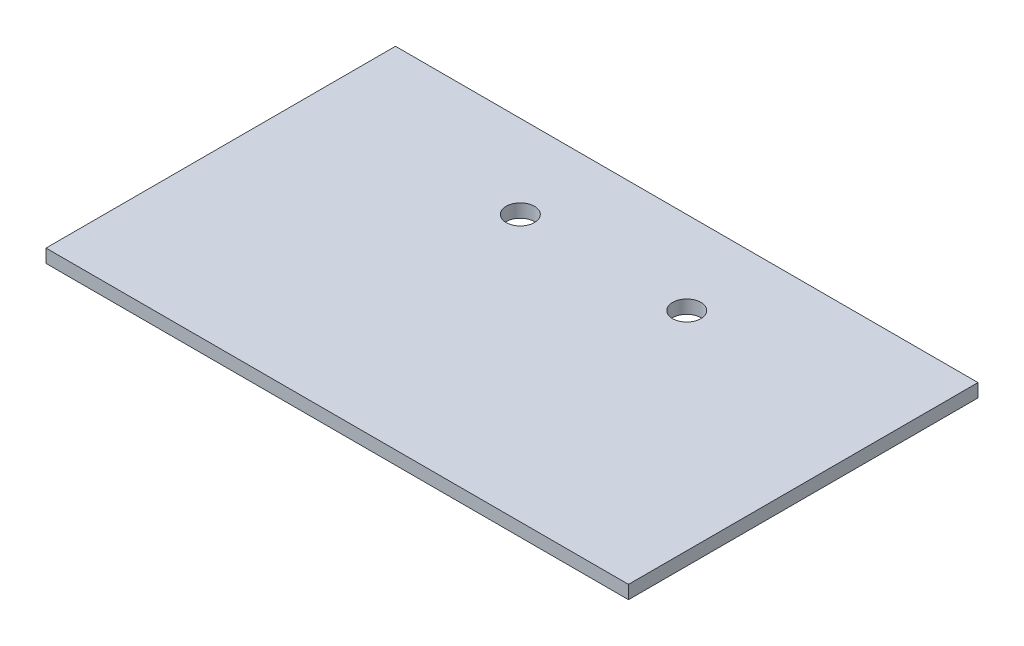
ISO-10303-21;
HEADER;
FILE_DESCRIPTION(('STEP AP214'),'2;1');
FILE_NAME('part.step','',(''),(''),'','','');
FILE_SCHEMA(('AUTOMOTIVE_DESIGN { 1 0 10303 214 1 1 1 1 }'));
ENDSEC;
DATA;
#1=APPLICATION_CONTEXT('core data for automotive mechanical design processes');
#2=APPLICATION_PROTOCOL_DEFINITION('international standard','automotive_design',2000,#1);
#3=PRODUCT_CONTEXT('',#1,'mechanical');
#4=PRODUCT('Part','Part','',(#3));
#5=PRODUCT_RELATED_PRODUCT_CATEGORY('part','',(#4));
#6=PRODUCT_DEFINITION_FORMATION('','',#4);
#7=PRODUCT_DEFINITION_CONTEXT('part definition',#1,'design');
#8=PRODUCT_DEFINITION('design','',#6,#7);
#9=PRODUCT_DEFINITION_SHAPE('','',#8);
#10=(LENGTH_UNIT() NAMED_UNIT(*) SI_UNIT(.MILLI.,.METRE.));
#11=(NAMED_UNIT(*) PLANE_ANGLE_UNIT() SI_UNIT($,.RADIAN.));
#12=(NAMED_UNIT(*) SI_UNIT($,.STERADIAN.) SOLID_ANGLE_UNIT());
#13=UNCERTAINTY_MEASURE_WITH_UNIT(LENGTH_MEASURE(1.E-05),#10,'distance_accuracy_value','');
#14=(GEOMETRIC_REPRESENTATION_CONTEXT(3) GLOBAL_UNCERTAINTY_ASSIGNED_CONTEXT((#13)) GLOBAL_UNIT_ASSIGNED_CONTEXT((#10,
#11,#12)) REPRESENTATION_CONTEXT('',''));
#15=CARTESIAN_POINT('',(0.,0.,0.));
#16=DIRECTION('',(0.,0.,1.));
#17=DIRECTION('',(1.,0.,0.));
#18=AXIS2_PLACEMENT_3D('',#15,#16,#17);
#19=CARTESIAN_POINT('',(0.,0.,0.));
#20=DIRECTION('',(0.,-1.,0.));
#21=DIRECTION('',(0.,0.,-1.));
#22=AXIS2_PLACEMENT_3D('',#19,#20,#21);
#23=PLANE('',#22);
#24=CARTESIAN_POINT('',(-10.,0.,-11.));
#25=DIRECTION('',(0.,-1.,0.));
#26=DIRECTION('',(0.,0.,-1.));
#27=AXIS2_PLACEMENT_3D('',#24,#25,#26);
#28=CIRCLE('',#27,1.7);
#29=CARTESIAN_POINT('',(-10.,0.,-12.7));
#30=VERTEX_POINT('',#29);
#31=EDGE_CURVE('E103',#30,#30,#28,.F.);
#32=ORIENTED_EDGE('',*,*,#31,.T.);
#33=EDGE_LOOP('',(#32));
#34=FACE_BOUND('',#33,.T.);
#35=DIRECTION('',(0.,0.,-1.));
#36=VECTOR('',#35,1.);
#37=CARTESIAN_POINT('',(35.,0.,21.));
#38=LINE('',#37,#36);
#39=CARTESIAN_POINT('',(35.,0.,21.));
#40=VERTEX_POINT('',#39);
#41=CARTESIAN_POINT('',(35.,0.,-21.));
#42=VERTEX_POINT('',#41);
#43=EDGE_CURVE('E100',#40,#42,#38,.T.);
#44=ORIENTED_EDGE('',*,*,#43,.F.);
#45=DIRECTION('',(1.,0.,0.));
#46=VECTOR('',#45,1.);
#47=CARTESIAN_POINT('',(-35.,0.,21.));
#48=LINE('',#47,#46);
#49=CARTESIAN_POINT('',(-35.,0.,21.));
#50=VERTEX_POINT('',#49);
#51=EDGE_CURVE('E75',#50,#40,#48,.T.);
#52=ORIENTED_EDGE('',*,*,#51,.F.);
#53=DIRECTION('',(0.,0.,1.));
#54=VECTOR('',#53,1.);
#55=CARTESIAN_POINT('',(-35.,0.,21.));
#56=LINE('',#55,#54);
#57=CARTESIAN_POINT('',(-35.,0.,-21.));
#58=VERTEX_POINT('',#57);
#59=EDGE_CURVE('E69',#58,#50,#56,.T.);
#60=ORIENTED_EDGE('',*,*,#59,.F.);
#61=DIRECTION('',(-1.,0.,0.));
#62=VECTOR('',#61,1.);
#63=CARTESIAN_POINT('',(-35.,0.,-21.));
#64=LINE('',#63,#62);
#65=EDGE_CURVE('E92',#42,#58,#64,.T.);
#66=ORIENTED_EDGE('',*,*,#65,.F.);
#67=EDGE_LOOP('',(#44,#52,#60,#66));
#68=FACE_BOUND('',#67,.T.);
#69=CARTESIAN_POINT('',(10.,0.,-11.));
#70=DIRECTION('',(0.,-1.,0.));
#71=DIRECTION('',(0.,0.,-1.));
#72=AXIS2_PLACEMENT_3D('',#69,#70,#71);
#73=CIRCLE('',#72,1.7);
#74=CARTESIAN_POINT('',(10.,0.,-12.7));
#75=VERTEX_POINT('',#74);
#76=EDGE_CURVE('E119',#75,#75,#73,.F.);
#77=ORIENTED_EDGE('',*,*,#76,.T.);
#78=EDGE_LOOP('',(#77));
#79=FACE_BOUND('',#78,.T.);
#80=ADVANCED_FACE('F35',(#34,#68,#79),#23,.T.);
#81=CARTESIAN_POINT('',(0.,1.6,0.));
#82=DIRECTION('',(0.,-1.,0.));
#83=DIRECTION('',(0.,0.,-1.));
#84=AXIS2_PLACEMENT_3D('',#81,#82,#83);
#85=PLANE('',#84);
#86=CARTESIAN_POINT('',(10.,1.6,-11.));
#87=DIRECTION('',(0.,1.,0.));
#88=DIRECTION('',(0.,0.,1.));
#89=AXIS2_PLACEMENT_3D('',#86,#87,#88);
#90=CIRCLE('',#89,1.7);
#91=CARTESIAN_POINT('',(10.,1.6,-9.3));
#92=VERTEX_POINT('',#91);
#93=EDGE_CURVE('E122',#92,#92,#90,.T.);
#94=ORIENTED_EDGE('',*,*,#93,.F.);
#95=EDGE_LOOP('',(#94));
#96=FACE_BOUND('',#95,.T.);
#97=DIRECTION('',(0.,0.,-1.));
#98=VECTOR('',#97,1.);
#99=CARTESIAN_POINT('',(35.,1.6,21.));
#100=LINE('',#99,#98);
#101=CARTESIAN_POINT('',(35.,1.6,21.));
#102=VERTEX_POINT('',#101);
#103=CARTESIAN_POINT('',(35.,1.6,-21.));
#104=VERTEX_POINT('',#103);
#105=EDGE_CURVE('E88',#102,#104,#100,.T.);
#106=ORIENTED_EDGE('',*,*,#105,.T.);
#107=DIRECTION('',(-1.,0.,0.));
#108=VECTOR('',#107,1.);
#109=CARTESIAN_POINT('',(-35.,1.6,-21.));
#110=LINE('',#109,#108);
#111=CARTESIAN_POINT('',(-35.,1.6,-21.));
#112=VERTEX_POINT('',#111);
#113=EDGE_CURVE('E82',#104,#112,#110,.T.);
#114=ORIENTED_EDGE('',*,*,#113,.T.);
#115=DIRECTION('',(0.,0.,1.));
#116=VECTOR('',#115,1.);
#117=CARTESIAN_POINT('',(-35.,1.6,21.));
#118=LINE('',#117,#116);
#119=CARTESIAN_POINT('',(-35.,1.6,21.));
#120=VERTEX_POINT('',#119);
#121=EDGE_CURVE('E86',#112,#120,#118,.T.);
#122=ORIENTED_EDGE('',*,*,#121,.T.);
#123=DIRECTION('',(1.,0.,0.));
#124=VECTOR('',#123,1.);
#125=CARTESIAN_POINT('',(-35.,1.6,21.));
#126=LINE('',#125,#124);
#127=EDGE_CURVE('E52',#120,#102,#126,.T.);
#128=ORIENTED_EDGE('',*,*,#127,.T.);
#129=EDGE_LOOP('',(#106,#114,#122,#128));
#130=FACE_BOUND('',#129,.T.);
#131=CARTESIAN_POINT('',(-10.,1.6,-11.));
#132=DIRECTION('',(0.,1.,0.));
#133=DIRECTION('',(0.,0.,1.));
#134=AXIS2_PLACEMENT_3D('',#131,#132,#133);
#135=CIRCLE('',#134,1.7);
#136=CARTESIAN_POINT('',(-10.,1.6,-9.3));
#137=VERTEX_POINT('',#136);
#138=EDGE_CURVE('E116',#137,#137,#135,.T.);
#139=ORIENTED_EDGE('',*,*,#138,.F.);
#140=EDGE_LOOP('',(#139));
#141=FACE_BOUND('',#140,.T.);
#142=ADVANCED_FACE('F83',(#96,#130,#141),#85,.F.);
#143=CARTESIAN_POINT('',(35.,1.6,21.));
#144=DIRECTION('',(-1.,0.,0.));
#145=DIRECTION('',(0.,0.,1.));
#146=AXIS2_PLACEMENT_3D('',#143,#144,#145);
#147=PLANE('',#146);
#148=ORIENTED_EDGE('',*,*,#43,.T.);
#149=DIRECTION('',(0.,-1.,0.));
#150=VECTOR('',#149,1.);
#151=CARTESIAN_POINT('',(35.,1.6,-21.));
#152=LINE('',#151,#150);
#153=EDGE_CURVE('E11',#104,#42,#152,.T.);
#154=ORIENTED_EDGE('',*,*,#153,.F.);
#155=ORIENTED_EDGE('',*,*,#105,.F.);
#156=DIRECTION('',(0.,-1.,0.));
#157=VECTOR('',#156,1.);
#158=CARTESIAN_POINT('',(35.,1.6,21.));
#159=LINE('',#158,#157);
#160=EDGE_CURVE('E96',#102,#40,#159,.T.);
#161=ORIENTED_EDGE('',*,*,#160,.T.);
#162=EDGE_LOOP('',(#148,#154,#155,#161));
#163=FACE_BOUND('',#162,.T.);
#164=ADVANCED_FACE('F37',(#163),#147,.F.);
#165=CARTESIAN_POINT('',(-35.,1.6,-21.));
#166=DIRECTION('',(0.,0.,1.));
#167=DIRECTION('',(1.,0.,0.));
#168=AXIS2_PLACEMENT_3D('',#165,#166,#167);
#169=PLANE('',#168);
#170=ORIENTED_EDGE('',*,*,#65,.T.);
#171=DIRECTION('',(0.,-1.,0.));
#172=VECTOR('',#171,1.);
#173=CARTESIAN_POINT('',(-35.,1.6,-21.));
#174=LINE('',#173,#172);
#175=EDGE_CURVE('E44',#112,#58,#174,.T.);
#176=ORIENTED_EDGE('',*,*,#175,.F.);
#177=ORIENTED_EDGE('',*,*,#113,.F.);
#178=ORIENTED_EDGE('',*,*,#153,.T.);
#179=EDGE_LOOP('',(#170,#176,#177,#178));
#180=FACE_BOUND('',#179,.T.);
#181=ADVANCED_FACE('F91',(#180),#169,.F.);
#182=CARTESIAN_POINT('',(-35.,1.6,21.));
#183=DIRECTION('',(1.,0.,0.));
#184=DIRECTION('',(0.,0.,-1.));
#185=AXIS2_PLACEMENT_3D('',#182,#183,#184);
#186=PLANE('',#185);
#187=ORIENTED_EDGE('',*,*,#59,.T.);
#188=DIRECTION('',(0.,-1.,0.));
#189=VECTOR('',#188,1.);
#190=CARTESIAN_POINT('',(-35.,1.6,21.));
#191=LINE('',#190,#189);
#192=EDGE_CURVE('E93',#120,#50,#191,.T.);
#193=ORIENTED_EDGE('',*,*,#192,.F.);
#194=ORIENTED_EDGE('',*,*,#121,.F.);
#195=ORIENTED_EDGE('',*,*,#175,.T.);
#196=EDGE_LOOP('',(#187,#193,#194,#195));
#197=FACE_BOUND('',#196,.T.);
#198=ADVANCED_FACE('F94',(#197),#186,.F.);
#199=CARTESIAN_POINT('',(-35.,1.6,21.));
#200=DIRECTION('',(0.,0.,-1.));
#201=DIRECTION('',(-1.,0.,0.));
#202=AXIS2_PLACEMENT_3D('',#199,#200,#201);
#203=PLANE('',#202);
#204=ORIENTED_EDGE('',*,*,#51,.T.);
#205=ORIENTED_EDGE('',*,*,#160,.F.);
#206=ORIENTED_EDGE('',*,*,#127,.F.);
#207=ORIENTED_EDGE('',*,*,#192,.T.);
#208=EDGE_LOOP('',(#204,#205,#206,#207));
#209=FACE_BOUND('',#208,.T.);
#210=ADVANCED_FACE('F108',(#209),#203,.F.);
#211=CARTESIAN_POINT('',(-10.,1.6,-11.));
#212=DIRECTION('',(0.,1.,0.));
#213=DIRECTION('',(0.,0.,1.));
#214=AXIS2_PLACEMENT_3D('',#211,#212,#213);
#215=CYLINDRICAL_SURFACE('',#214,1.7);
#216=ORIENTED_EDGE('',*,*,#31,.F.);
#217=EDGE_LOOP('',(#216));
#218=FACE_BOUND('',#217,.T.);
#219=ORIENTED_EDGE('',*,*,#138,.T.);
#220=EDGE_LOOP('',(#219));
#221=FACE_BOUND('',#220,.T.);
#222=ADVANCED_FACE('F137',(#218,#221),#215,.F.);
#223=CARTESIAN_POINT('',(10.,1.6,-11.));
#224=DIRECTION('',(0.,1.,0.));
#225=DIRECTION('',(0.,0.,1.));
#226=AXIS2_PLACEMENT_3D('',#223,#224,#225);
#227=CYLINDRICAL_SURFACE('',#226,1.7);
#228=ORIENTED_EDGE('',*,*,#76,.F.);
#229=EDGE_LOOP('',(#228));
#230=FACE_BOUND('',#229,.T.);
#231=ORIENTED_EDGE('',*,*,#93,.T.);
#232=EDGE_LOOP('',(#231));
#233=FACE_BOUND('',#232,.T.);
#234=ADVANCED_FACE('F126',(#230,#233),#227,.F.);
#235=CLOSED_SHELL('',(#80,#142,#164,#181,#198,#210,#222,#234));
#236=MANIFOLD_SOLID_BREP('B2',#235);
#237=ADVANCED_BREP_SHAPE_REPRESENTATION('',(#18,#236),#14);
#238=SHAPE_DEFINITION_REPRESENTATION(#9,#237);
ENDSEC;
END-ISO-10303-21;
